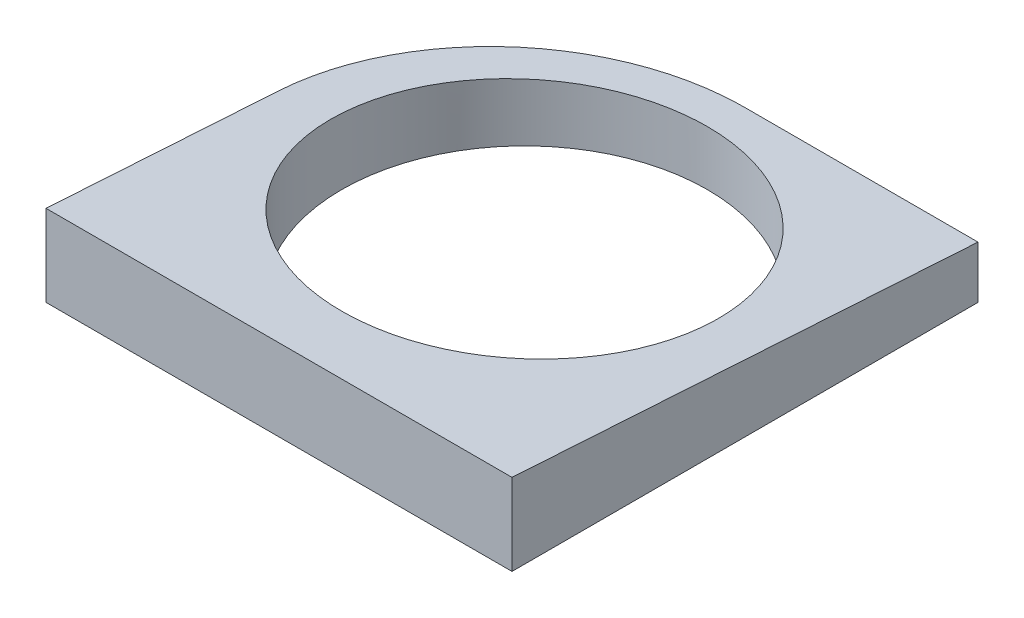
ISO-10303-21;
HEADER;
FILE_DESCRIPTION(('STEP AP214'),'2;1');
FILE_NAME('part.step','',(''),(''),'','','');
FILE_SCHEMA(('AUTOMOTIVE_DESIGN { 1 0 10303 214 1 1 1 1 }'));
ENDSEC;
DATA;
#1=APPLICATION_CONTEXT('core data for automotive mechanical design processes');
#2=APPLICATION_PROTOCOL_DEFINITION('international standard','automotive_design',2000,#1);
#3=PRODUCT_CONTEXT('',#1,'mechanical');
#4=PRODUCT('Part','Part','',(#3));
#5=PRODUCT_RELATED_PRODUCT_CATEGORY('part','',(#4));
#6=PRODUCT_DEFINITION_FORMATION('','',#4);
#7=PRODUCT_DEFINITION_CONTEXT('part definition',#1,'design');
#8=PRODUCT_DEFINITION('design','',#6,#7);
#9=PRODUCT_DEFINITION_SHAPE('','',#8);
#10=(LENGTH_UNIT() NAMED_UNIT(*) SI_UNIT(.MILLI.,.METRE.));
#11=(NAMED_UNIT(*) PLANE_ANGLE_UNIT() SI_UNIT($,.RADIAN.));
#12=(NAMED_UNIT(*) SI_UNIT($,.STERADIAN.) SOLID_ANGLE_UNIT());
#13=UNCERTAINTY_MEASURE_WITH_UNIT(LENGTH_MEASURE(1.E-05),#10,'distance_accuracy_value','');
#14=(GEOMETRIC_REPRESENTATION_CONTEXT(3) GLOBAL_UNCERTAINTY_ASSIGNED_CONTEXT((#13)) GLOBAL_UNIT_ASSIGNED_CONTEXT((#10,
#11,#12)) REPRESENTATION_CONTEXT('',''));
#15=CARTESIAN_POINT('',(0.,0.,0.));
#16=DIRECTION('',(0.,0.,1.));
#17=DIRECTION('',(1.,0.,0.));
#18=AXIS2_PLACEMENT_3D('',#15,#16,#17);
#19=CARTESIAN_POINT('',(0.,0.,1.2));
#20=DIRECTION('',(0.,1.,0.));
#21=DIRECTION('',(0.,0.,1.));
#22=AXIS2_PLACEMENT_3D('',#19,#20,#21);
#23=PLANE('',#22);
#24=DIRECTION('',(0.,0.,1.));
#25=VECTOR('',#24,1.);
#26=CARTESIAN_POINT('',(-22.3,0.,1.2));
#27=LINE('',#26,#25);
#28=CARTESIAN_POINT('',(-22.3,0.,1.2));
#29=VERTEX_POINT('',#28);
#30=CARTESIAN_POINT('',(-22.3,0.,23.5));
#31=VERTEX_POINT('',#30);
#32=EDGE_CURVE('E95',#29,#31,#27,.T.);
#33=ORIENTED_EDGE('',*,*,#32,.F.);
#34=CARTESIAN_POINT('',(0.,0.,1.2));
#35=DIRECTION('',(0.,1.,0.));
#36=DIRECTION('',(0.,0.,1.));
#37=AXIS2_PLACEMENT_3D('',#34,#35,#36);
#38=CIRCLE('',#37,22.3);
#39=CARTESIAN_POINT('',(0.,0.,-21.1));
#40=VERTEX_POINT('',#39);
#41=EDGE_CURVE('E112',#40,#29,#38,.T.);
#42=ORIENTED_EDGE('',*,*,#41,.F.);
#43=DIRECTION('',(-1.,0.,0.));
#44=VECTOR('',#43,1.);
#45=CARTESIAN_POINT('',(22.3,0.,-21.1));
#46=LINE('',#45,#44);
#47=CARTESIAN_POINT('',(22.3,0.,-21.1));
#48=VERTEX_POINT('',#47);
#49=EDGE_CURVE('E109',#48,#40,#46,.T.);
#50=ORIENTED_EDGE('',*,*,#49,.F.);
#51=DIRECTION('',(0.,0.,-1.));
#52=VECTOR('',#51,1.);
#53=CARTESIAN_POINT('',(22.3,0.,23.5));
#54=LINE('',#53,#52);
#55=CARTESIAN_POINT('',(22.3,0.,23.5));
#56=VERTEX_POINT('',#55);
#57=EDGE_CURVE('E101',#56,#48,#54,.T.);
#58=ORIENTED_EDGE('',*,*,#57,.F.);
#59=DIRECTION('',(1.,0.,0.));
#60=VECTOR('',#59,1.);
#61=CARTESIAN_POINT('',(-22.3,0.,23.5));
#62=LINE('',#61,#60);
#63=EDGE_CURVE('E98',#31,#56,#62,.T.);
#64=ORIENTED_EDGE('',*,*,#63,.F.);
#65=EDGE_LOOP('',(#33,#42,#50,#58,#64));
#66=FACE_BOUND('',#65,.T.);
#67=CARTESIAN_POINT('',(0.,0.,0.));
#68=DIRECTION('',(0.,1.,0.));
#69=DIRECTION('',(0.,0.,1.));
#70=AXIS2_PLACEMENT_3D('',#67,#68,#69);
#71=CIRCLE('',#70,17.5);
#72=CARTESIAN_POINT('',(0.,0.,17.5));
#73=VERTEX_POINT('',#72);
#74=EDGE_CURVE('E99',#73,#73,#71,.T.);
#75=ORIENTED_EDGE('',*,*,#74,.T.);
#76=EDGE_LOOP('',(#75));
#77=FACE_BOUND('',#76,.T.);
#78=ADVANCED_FACE('F33',(#66,#77),#23,.F.);
#79=CARTESIAN_POINT('',(-22.3,300.,1.2));
#80=DIRECTION('',(1.,0.,0.));
#81=DIRECTION('',(0.,0.,-1.));
#82=AXIS2_PLACEMENT_3D('',#79,#80,#81);
#83=PLANE('',#82);
#84=DIRECTION('',(0.,-1.,0.));
#85=VECTOR('',#84,1.);
#86=CARTESIAN_POINT('',(-22.3,300.,23.5));
#87=LINE('',#86,#85);
#88=CARTESIAN_POINT('',(-22.3,7.8,23.5));
#89=VERTEX_POINT('',#88);
#90=EDGE_CURVE('E11',#89,#31,#87,.T.);
#91=ORIENTED_EDGE('',*,*,#90,.F.);
#92=DIRECTION('',(0.,-0.0626569136907482,-0.998035125216919));
#93=VECTOR('',#92,1.);
#94=CARTESIAN_POINT('',(-22.3,7.55264096144209,19.5599238858287));
#95=LINE('',#94,#93);
#96=CARTESIAN_POINT('',(-22.3,6.39999999999996,1.2));
#97=VERTEX_POINT('',#96);
#98=EDGE_CURVE('E79',#89,#97,#95,.T.);
#99=ORIENTED_EDGE('',*,*,#98,.T.);
#100=DIRECTION('',(0.,-1.,0.));
#101=VECTOR('',#100,1.);
#102=CARTESIAN_POINT('',(-22.3,300.,1.2));
#103=LINE('',#102,#101);
#104=EDGE_CURVE('E57',#97,#29,#103,.T.);
#105=ORIENTED_EDGE('',*,*,#104,.T.);
#106=ORIENTED_EDGE('',*,*,#32,.T.);
#107=EDGE_LOOP('',(#91,#99,#105,#106));
#108=FACE_BOUND('',#107,.T.);
#109=ADVANCED_FACE('F35',(#108),#83,.F.);
#110=CARTESIAN_POINT('',(-22.3,300.,23.5));
#111=DIRECTION('',(0.,0.,-1.));
#112=DIRECTION('',(-1.,0.,0.));
#113=AXIS2_PLACEMENT_3D('',#110,#111,#112);
#114=PLANE('',#113);
#115=DIRECTION('',(0.,-1.,0.));
#116=VECTOR('',#115,1.);
#117=CARTESIAN_POINT('',(22.3,300.,23.5));
#118=LINE('',#117,#116);
#119=CARTESIAN_POINT('',(22.3,7.8,23.5));
#120=VERTEX_POINT('',#119);
#121=EDGE_CURVE('E42',#120,#56,#118,.T.);
#122=ORIENTED_EDGE('',*,*,#121,.F.);
#123=DIRECTION('',(1.,0.,0.));
#124=VECTOR('',#123,1.);
#125=CARTESIAN_POINT('',(-150.,7.8,23.5));
#126=LINE('',#125,#124);
#127=EDGE_CURVE('E82',#89,#120,#126,.T.);
#128=ORIENTED_EDGE('',*,*,#127,.F.);
#129=ORIENTED_EDGE('',*,*,#90,.T.);
#130=ORIENTED_EDGE('',*,*,#63,.T.);
#131=EDGE_LOOP('',(#122,#128,#129,#130));
#132=FACE_BOUND('',#131,.T.);
#133=ADVANCED_FACE('F90',(#132),#114,.F.);
#134=CARTESIAN_POINT('',(22.3,300.,23.5));
#135=DIRECTION('',(-1.,0.,0.));
#136=DIRECTION('',(0.,0.,1.));
#137=AXIS2_PLACEMENT_3D('',#134,#135,#136);
#138=PLANE('',#137);
#139=DIRECTION('',(0.,-1.,0.));
#140=VECTOR('',#139,1.);
#141=CARTESIAN_POINT('',(22.3,300.,-21.1));
#142=LINE('',#141,#140);
#143=CARTESIAN_POINT('',(22.3,5.,-21.1));
#144=VERTEX_POINT('',#143);
#145=EDGE_CURVE('E117',#144,#48,#142,.T.);
#146=ORIENTED_EDGE('',*,*,#145,.F.);
#147=DIRECTION('',(0.,0.0626569136907482,0.998035125216919));
#148=VECTOR('',#147,1.);
#149=CARTESIAN_POINT('',(22.3,8.94714471707558,41.7723765648473));
#150=LINE('',#149,#148);
#151=EDGE_CURVE('E86',#144,#120,#150,.T.);
#152=ORIENTED_EDGE('',*,*,#151,.T.);
#153=ORIENTED_EDGE('',*,*,#121,.T.);
#154=ORIENTED_EDGE('',*,*,#57,.T.);
#155=EDGE_LOOP('',(#146,#152,#153,#154));
#156=FACE_BOUND('',#155,.T.);
#157=ADVANCED_FACE('F121',(#156),#138,.F.);
#158=CARTESIAN_POINT('',(22.3,300.,-21.1));
#159=DIRECTION('',(0.,0.,1.));
#160=DIRECTION('',(1.,0.,0.));
#161=AXIS2_PLACEMENT_3D('',#158,#159,#160);
#162=PLANE('',#161);
#163=DIRECTION('',(0.,-1.,0.));
#164=VECTOR('',#163,1.);
#165=CARTESIAN_POINT('',(0.,300.,-21.1));
#166=LINE('',#165,#164);
#167=CARTESIAN_POINT('',(0.,4.99999999999995,-21.1));
#168=VERTEX_POINT('',#167);
#169=EDGE_CURVE('E115',#168,#40,#166,.T.);
#170=ORIENTED_EDGE('',*,*,#169,.F.);
#171=DIRECTION('',(1.,0.,0.));
#172=VECTOR('',#171,1.);
#173=CARTESIAN_POINT('',(-150.,5.,-21.1));
#174=LINE('',#173,#172);
#175=EDGE_CURVE('E49',#168,#144,#174,.T.);
#176=ORIENTED_EDGE('',*,*,#175,.T.);
#177=ORIENTED_EDGE('',*,*,#145,.T.);
#178=ORIENTED_EDGE('',*,*,#49,.T.);
#179=EDGE_LOOP('',(#170,#176,#177,#178));
#180=FACE_BOUND('',#179,.T.);
#181=ADVANCED_FACE('F127',(#180),#162,.F.);
#182=CARTESIAN_POINT('',(0.,300.,1.2));
#183=DIRECTION('',(0.,-1.,0.));
#184=DIRECTION('',(0.,0.,-1.));
#185=AXIS2_PLACEMENT_3D('',#182,#183,#184);
#186=CYLINDRICAL_SURFACE('',#185,22.3);
#187=ORIENTED_EDGE('',*,*,#104,.F.);
#188=CARTESIAN_POINT('',(0.,6.39999999999996,1.2));
#189=DIRECTION('',(0.,-0.998035125216918,0.0626569136907482));
#190=DIRECTION('',(0.,-0.0626569136907482,-0.998035125216919));
#191=AXIS2_PLACEMENT_3D('',#188,#189,#190);
#192=ELLIPSE('',#191,22.3439029715043,22.3);
#193=EDGE_CURVE('E84',#97,#168,#192,.T.);
#194=ORIENTED_EDGE('',*,*,#193,.T.);
#195=ORIENTED_EDGE('',*,*,#169,.T.);
#196=ORIENTED_EDGE('',*,*,#41,.T.);
#197=EDGE_LOOP('',(#187,#194,#195,#196));
#198=FACE_BOUND('',#197,.T.);
#199=ADVANCED_FACE('F132',(#198),#186,.T.);
#200=CARTESIAN_POINT('',(0.,300.,0.));
#201=DIRECTION('',(0.,-1.,0.));
#202=DIRECTION('',(0.,0.,-1.));
#203=AXIS2_PLACEMENT_3D('',#200,#201,#202);
#204=CYLINDRICAL_SURFACE('',#203,17.5);
#205=CARTESIAN_POINT('',(0.,6.32466367713003,0.));
#206=DIRECTION('',(0.,-0.998035125216918,0.0626569136907482));
#207=DIRECTION('',(0.,-0.0626569136907482,-0.998035125216919));
#208=AXIS2_PLACEMENT_3D('',#205,#206,#207);
#209=ELLIPSE('',#208,17.5344530045438,17.5);
#210=CARTESIAN_POINT('',(0.,5.22600896860985,-17.5));
#211=VERTEX_POINT('',#210);
#212=EDGE_CURVE('E37',#211,#211,#209,.T.);
#213=ORIENTED_EDGE('',*,*,#212,.F.);
#214=EDGE_LOOP('',(#213));
#215=FACE_BOUND('',#214,.T.);
#216=ORIENTED_EDGE('',*,*,#74,.F.);
#217=EDGE_LOOP('',(#216));
#218=FACE_BOUND('',#217,.T.);
#219=ADVANCED_FACE('F134',(#215,#218),#204,.F.);
#220=CARTESIAN_POINT('',(-150.,7.8,23.5));
#221=DIRECTION('',(0.,-0.998035125216918,0.0626569136907482));
#222=DIRECTION('',(0.,-0.0626569136907482,-0.998035125216919));
#223=AXIS2_PLACEMENT_3D('',#220,#221,#222);
#224=PLANE('',#223);
#225=ORIENTED_EDGE('',*,*,#212,.T.);
#226=EDGE_LOOP('',(#225));
#227=FACE_BOUND('',#226,.T.);
#228=ORIENTED_EDGE('',*,*,#175,.F.);
#229=ORIENTED_EDGE('',*,*,#193,.F.);
#230=ORIENTED_EDGE('',*,*,#98,.F.);
#231=ORIENTED_EDGE('',*,*,#127,.T.);
#232=ORIENTED_EDGE('',*,*,#151,.F.);
#233=EDGE_LOOP('',(#228,#229,#230,#231,#232));
#234=FACE_BOUND('',#233,.T.);
#235=ADVANCED_FACE('F81',(#227,#234),#224,.F.);
#236=CLOSED_SHELL('',(#78,#109,#133,#157,#181,#199,#219,#235));
#237=MANIFOLD_SOLID_BREP('B2',#236);
#238=ADVANCED_BREP_SHAPE_REPRESENTATION('',(#18,#237),#14);
#239=SHAPE_DEFINITION_REPRESENTATION(#9,#238);
ENDSEC;
END-ISO-10303-21;
